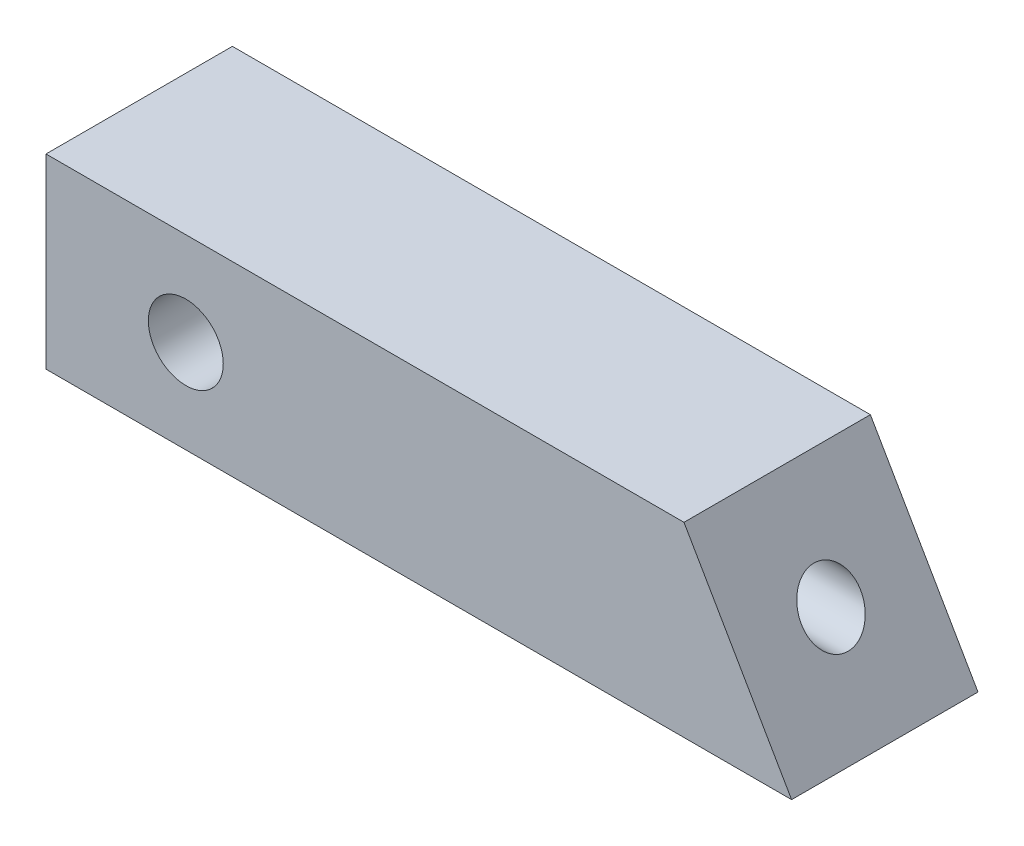
ISO-10303-21;
HEADER;
FILE_DESCRIPTION(('STEP AP214'),'2;1');
FILE_NAME('part.step','',(''),(''),'','','');
FILE_SCHEMA(('AUTOMOTIVE_DESIGN { 1 0 10303 214 1 1 1 1 }'));
ENDSEC;
DATA;
#1=APPLICATION_CONTEXT('core data for automotive mechanical design processes');
#2=APPLICATION_PROTOCOL_DEFINITION('international standard','automotive_design',2000,#1);
#3=PRODUCT_CONTEXT('',#1,'mechanical');
#4=PRODUCT('Part','Part','',(#3));
#5=PRODUCT_RELATED_PRODUCT_CATEGORY('part','',(#4));
#6=PRODUCT_DEFINITION_FORMATION('','',#4);
#7=PRODUCT_DEFINITION_CONTEXT('part definition',#1,'design');
#8=PRODUCT_DEFINITION('design','',#6,#7);
#9=PRODUCT_DEFINITION_SHAPE('','',#8);
#10=(LENGTH_UNIT() NAMED_UNIT(*) SI_UNIT(.MILLI.,.METRE.));
#11=(NAMED_UNIT(*) PLANE_ANGLE_UNIT() SI_UNIT($,.RADIAN.));
#12=(NAMED_UNIT(*) SI_UNIT($,.STERADIAN.) SOLID_ANGLE_UNIT());
#13=UNCERTAINTY_MEASURE_WITH_UNIT(LENGTH_MEASURE(1.E-05),#10,'distance_accuracy_value','');
#14=(GEOMETRIC_REPRESENTATION_CONTEXT(3) GLOBAL_UNCERTAINTY_ASSIGNED_CONTEXT((#13)) GLOBAL_UNIT_ASSIGNED_CONTEXT((#10,
#11,#12)) REPRESENTATION_CONTEXT('',''));
#15=CARTESIAN_POINT('',(0.,0.,0.));
#16=DIRECTION('',(0.,0.,1.));
#17=DIRECTION('',(1.,0.,0.));
#18=AXIS2_PLACEMENT_3D('',#15,#16,#17);
#19=CARTESIAN_POINT('',(50.8,0.,0.));
#20=DIRECTION('',(0.,0.,-1.));
#21=DIRECTION('',(-1.,0.,0.));
#22=AXIS2_PLACEMENT_3D('',#19,#20,#21);
#23=PLANE('',#22);
#24=CARTESIAN_POINT('',(9.525,6.35,0.));
#25=DIRECTION('',(0.,0.,1.));
#26=DIRECTION('',(1.,0.,0.));
#27=AXIS2_PLACEMENT_3D('',#24,#25,#26);
#28=CIRCLE('',#27,2.55269999999999);
#29=CARTESIAN_POINT('',(12.0777,6.35,0.));
#30=VERTEX_POINT('',#29);
#31=EDGE_CURVE('E132',#30,#30,#28,.T.);
#32=ORIENTED_EDGE('',*,*,#31,.F.);
#33=EDGE_LOOP('',(#32));
#34=FACE_BOUND('',#33,.T.);
#35=DIRECTION('',(-0.499999999999995,0.866025403784442,0.));
#36=VECTOR('',#35,1.);
#37=CARTESIAN_POINT('',(38.1000000000003,21.9970452561246,0.));
#38=LINE('',#37,#36);
#39=CARTESIAN_POINT('',(50.8,0.,0.));
#40=VERTEX_POINT('',#39);
#41=CARTESIAN_POINT('',(43.4676515812919,12.7,0.));
#42=VERTEX_POINT('',#41);
#43=EDGE_CURVE('E51',#40,#42,#38,.T.);
#44=ORIENTED_EDGE('',*,*,#43,.T.);
#45=DIRECTION('',(-1.,0.,0.));
#46=VECTOR('',#45,1.);
#47=CARTESIAN_POINT('',(50.8,12.7,0.));
#48=LINE('',#47,#46);
#49=CARTESIAN_POINT('',(0.,12.7,0.));
#50=VERTEX_POINT('',#49);
#51=EDGE_CURVE('E80',#42,#50,#48,.T.);
#52=ORIENTED_EDGE('',*,*,#51,.T.);
#53=DIRECTION('',(0.,-1.,0.));
#54=VECTOR('',#53,1.);
#55=CARTESIAN_POINT('',(0.,0.,0.));
#56=LINE('',#55,#54);
#57=CARTESIAN_POINT('',(0.,0.,0.));
#58=VERTEX_POINT('',#57);
#59=EDGE_CURVE('E92',#50,#58,#56,.T.);
#60=ORIENTED_EDGE('',*,*,#59,.T.);
#61=DIRECTION('',(-1.,0.,0.));
#62=VECTOR('',#61,1.);
#63=CARTESIAN_POINT('',(50.8,0.,0.));
#64=LINE('',#63,#62);
#65=EDGE_CURVE('E11',#40,#58,#64,.T.);
#66=ORIENTED_EDGE('',*,*,#65,.F.);
#67=EDGE_LOOP('',(#44,#52,#60,#66));
#68=FACE_BOUND('',#67,.T.);
#69=ADVANCED_FACE('F35',(#34,#68),#23,.F.);
#70=CARTESIAN_POINT('',(50.8,0.,-12.7));
#71=DIRECTION('',(0.,0.,1.));
#72=DIRECTION('',(1.,0.,0.));
#73=AXIS2_PLACEMENT_3D('',#70,#71,#72);
#74=PLANE('',#73);
#75=CARTESIAN_POINT('',(9.525,6.35,-12.7));
#76=DIRECTION('',(0.,0.,1.));
#77=DIRECTION('',(1.,0.,0.));
#78=AXIS2_PLACEMENT_3D('',#75,#76,#77);
#79=CIRCLE('',#78,2.55269999999999);
#80=CARTESIAN_POINT('',(12.0777,6.35,-12.7));
#81=VERTEX_POINT('',#80);
#82=EDGE_CURVE('E128',#81,#81,#79,.T.);
#83=ORIENTED_EDGE('',*,*,#82,.T.);
#84=EDGE_LOOP('',(#83));
#85=FACE_BOUND('',#84,.T.);
#86=DIRECTION('',(-0.499999999999995,0.866025403784442,0.));
#87=VECTOR('',#86,1.);
#88=CARTESIAN_POINT('',(38.1000000000003,21.9970452561246,-12.7));
#89=LINE('',#88,#87);
#90=CARTESIAN_POINT('',(50.8,0.,-12.7));
#91=VERTEX_POINT('',#90);
#92=CARTESIAN_POINT('',(43.4676515812919,12.7,-12.7));
#93=VERTEX_POINT('',#92);
#94=EDGE_CURVE('E106',#91,#93,#89,.T.);
#95=ORIENTED_EDGE('',*,*,#94,.F.);
#96=DIRECTION('',(-1.,0.,0.));
#97=VECTOR('',#96,1.);
#98=CARTESIAN_POINT('',(50.8,0.,-12.7));
#99=LINE('',#98,#97);
#100=CARTESIAN_POINT('',(0.,0.,-12.7));
#101=VERTEX_POINT('',#100);
#102=EDGE_CURVE('E44',#91,#101,#99,.T.);
#103=ORIENTED_EDGE('',*,*,#102,.T.);
#104=DIRECTION('',(0.,1.,0.));
#105=VECTOR('',#104,1.);
#106=CARTESIAN_POINT('',(0.,0.,-12.7));
#107=LINE('',#106,#105);
#108=CARTESIAN_POINT('',(0.,12.7,-12.7));
#109=VERTEX_POINT('',#108);
#110=EDGE_CURVE('E84',#101,#109,#107,.T.);
#111=ORIENTED_EDGE('',*,*,#110,.T.);
#112=DIRECTION('',(-1.,0.,0.));
#113=VECTOR('',#112,1.);
#114=CARTESIAN_POINT('',(50.8,12.7,-12.7));
#115=LINE('',#114,#113);
#116=EDGE_CURVE('E69',#93,#109,#115,.T.);
#117=ORIENTED_EDGE('',*,*,#116,.F.);
#118=EDGE_LOOP('',(#95,#103,#111,#117));
#119=FACE_BOUND('',#118,.T.);
#120=ADVANCED_FACE('F85',(#85,#119),#74,.F.);
#121=CARTESIAN_POINT('',(50.8,12.7,0.));
#122=DIRECTION('',(0.,-1.,0.));
#123=DIRECTION('',(0.,0.,-1.));
#124=AXIS2_PLACEMENT_3D('',#121,#122,#123);
#125=PLANE('',#124);
#126=DIRECTION('',(0.,0.,1.));
#127=VECTOR('',#126,1.);
#128=CARTESIAN_POINT('',(43.4676515812919,12.7,-12.7));
#129=LINE('',#128,#127);
#130=EDGE_CURVE('E77',#93,#42,#129,.T.);
#131=ORIENTED_EDGE('',*,*,#130,.F.);
#132=ORIENTED_EDGE('',*,*,#116,.T.);
#133=DIRECTION('',(0.,0.,1.));
#134=VECTOR('',#133,1.);
#135=CARTESIAN_POINT('',(0.,12.7,0.));
#136=LINE('',#135,#134);
#137=EDGE_CURVE('E74',#109,#50,#136,.T.);
#138=ORIENTED_EDGE('',*,*,#137,.T.);
#139=ORIENTED_EDGE('',*,*,#51,.F.);
#140=EDGE_LOOP('',(#131,#132,#138,#139));
#141=FACE_BOUND('',#140,.T.);
#142=ADVANCED_FACE('F71',(#141),#125,.F.);
#143=CARTESIAN_POINT('',(50.8,0.,0.));
#144=DIRECTION('',(0.,1.,0.));
#145=DIRECTION('',(0.,0.,1.));
#146=AXIS2_PLACEMENT_3D('',#143,#144,#145);
#147=PLANE('',#146);
#148=DIRECTION('',(0.,0.,-1.));
#149=VECTOR('',#148,1.);
#150=CARTESIAN_POINT('',(0.,0.,0.));
#151=LINE('',#150,#149);
#152=EDGE_CURVE('E88',#58,#101,#151,.T.);
#153=ORIENTED_EDGE('',*,*,#152,.T.);
#154=ORIENTED_EDGE('',*,*,#102,.F.);
#155=DIRECTION('',(0.,0.,-1.));
#156=VECTOR('',#155,1.);
#157=CARTESIAN_POINT('',(50.8,0.,0.));
#158=LINE('',#157,#156);
#159=EDGE_CURVE('E93',#40,#91,#158,.T.);
#160=ORIENTED_EDGE('',*,*,#159,.F.);
#161=ORIENTED_EDGE('',*,*,#65,.T.);
#162=EDGE_LOOP('',(#153,#154,#160,#161));
#163=FACE_BOUND('',#162,.T.);
#164=ADVANCED_FACE('F125',(#163),#147,.F.);
#165=CARTESIAN_POINT('',(0.,0.,0.));
#166=DIRECTION('',(-1.,0.,0.));
#167=DIRECTION('',(0.,0.,1.));
#168=AXIS2_PLACEMENT_3D('',#165,#166,#167);
#169=PLANE('',#168);
#170=ORIENTED_EDGE('',*,*,#59,.F.);
#171=ORIENTED_EDGE('',*,*,#137,.F.);
#172=ORIENTED_EDGE('',*,*,#110,.F.);
#173=ORIENTED_EDGE('',*,*,#152,.F.);
#174=EDGE_LOOP('',(#170,#171,#172,#173));
#175=FACE_BOUND('',#174,.T.);
#176=ADVANCED_FACE('F90',(#175),#169,.T.);
#177=CARTESIAN_POINT('',(38.1000000000003,21.9970452561246,-12.7));
#178=DIRECTION('',(0.866025403784442,0.499999999999995,0.));
#179=DIRECTION('',(-0.499999999999995,0.866025403784442,0.));
#180=AXIS2_PLACEMENT_3D('',#177,#178,#179);
#181=PLANE('',#180);
#182=ORIENTED_EDGE('',*,*,#43,.F.);
#183=ORIENTED_EDGE('',*,*,#159,.T.);
#184=ORIENTED_EDGE('',*,*,#94,.T.);
#185=ORIENTED_EDGE('',*,*,#130,.T.);
#186=EDGE_LOOP('',(#182,#183,#184,#185));
#187=FACE_BOUND('',#186,.T.);
#188=CARTESIAN_POINT('',(47.1338257906459,6.35,-6.35));
#189=DIRECTION('',(0.866025403784442,0.499999999999995,0.));
#190=DIRECTION('',(0.499999999999995,-0.866025403784442,0.));
#191=AXIS2_PLACEMENT_3D('',#188,#189,#190);
#192=ELLIPSE('',#191,2.33168679714921,2.01929999999999);
#193=CARTESIAN_POINT('',(48.2996691892205,4.33070000000001,-6.35));
#194=VERTEX_POINT('',#193);
#195=EDGE_CURVE('E38',#194,#194,#192,.F.);
#196=ORIENTED_EDGE('',*,*,#195,.T.);
#197=EDGE_LOOP('',(#196));
#198=FACE_BOUND('',#197,.T.);
#199=ADVANCED_FACE('F113',(#187,#198),#181,.T.);
#200=CARTESIAN_POINT('',(25.4,6.35,-6.35));
#201=DIRECTION('',(1.,0.,0.));
#202=DIRECTION('',(0.,0.,-1.));
#203=AXIS2_PLACEMENT_3D('',#200,#201,#202);
#204=CONICAL_SURFACE('',#203,2.0193,1.02974425867665);
#205=CARTESIAN_POINT('',(24.1866821519976,6.34999999999999,-6.35));
#206=VERTEX_POINT('',#205);
#207=VERTEX_LOOP('',#206);
#208=FACE_BOUND('',#207,.T.);
#209=CARTESIAN_POINT('',(25.4,6.35,-6.35));
#210=DIRECTION('',(1.,0.,0.));
#211=DIRECTION('',(0.,0.,-1.));
#212=AXIS2_PLACEMENT_3D('',#209,#210,#211);
#213=CIRCLE('',#212,2.0193);
#214=CARTESIAN_POINT('',(25.4,6.35,-8.3693));
#215=VERTEX_POINT('',#214);
#216=EDGE_CURVE('E117',#215,#215,#213,.T.);
#217=ORIENTED_EDGE('',*,*,#216,.T.);
#218=EDGE_LOOP('',(#217));
#219=FACE_BOUND('',#218,.T.);
#220=ADVANCED_FACE('F109',(#208,#219),#204,.F.);
#221=CARTESIAN_POINT('',(50.8,6.35,-6.35));
#222=DIRECTION('',(1.,0.,0.));
#223=DIRECTION('',(0.,0.,-1.));
#224=AXIS2_PLACEMENT_3D('',#221,#222,#223);
#225=CYLINDRICAL_SURFACE('',#224,2.01929999999999);
#226=ORIENTED_EDGE('',*,*,#216,.F.);
#227=EDGE_LOOP('',(#226));
#228=FACE_BOUND('',#227,.T.);
#229=ORIENTED_EDGE('',*,*,#195,.F.);
#230=EDGE_LOOP('',(#229));
#231=FACE_BOUND('',#230,.T.);
#232=ADVANCED_FACE('F112',(#228,#231),#225,.F.);
#233=CARTESIAN_POINT('',(9.525,6.35,0.));
#234=DIRECTION('',(0.,0.,1.));
#235=DIRECTION('',(1.,0.,0.));
#236=AXIS2_PLACEMENT_3D('',#233,#234,#235);
#237=CYLINDRICAL_SURFACE('',#236,2.55269999999999);
#238=ORIENTED_EDGE('',*,*,#82,.F.);
#239=EDGE_LOOP('',(#238));
#240=FACE_BOUND('',#239,.T.);
#241=ORIENTED_EDGE('',*,*,#31,.T.);
#242=EDGE_LOOP('',(#241));
#243=FACE_BOUND('',#242,.T.);
#244=ADVANCED_FACE('F136',(#240,#243),#237,.F.);
#245=CLOSED_SHELL('',(#69,#120,#142,#164,#176,#199,#220,#232,#244));
#246=MANIFOLD_SOLID_BREP('B2',#245);
#247=ADVANCED_BREP_SHAPE_REPRESENTATION('',(#18,#246),#14);
#248=SHAPE_DEFINITION_REPRESENTATION(#9,#247);
ENDSEC;
END-ISO-10303-21;
